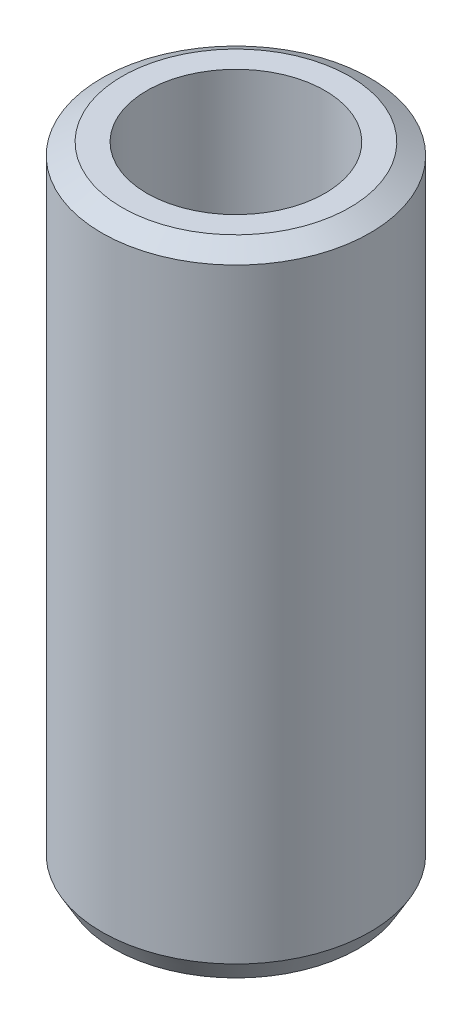
ISO-10303-21;
HEADER;
FILE_DESCRIPTION(('STEP AP214'),'2;1');
FILE_NAME('part.step','',(''),(''),'','','');
FILE_SCHEMA(('AUTOMOTIVE_DESIGN { 1 0 10303 214 1 1 1 1 }'));
ENDSEC;
DATA;
#1=APPLICATION_CONTEXT('core data for automotive mechanical design processes');
#2=APPLICATION_PROTOCOL_DEFINITION('international standard','automotive_design',2000,#1);
#3=PRODUCT_CONTEXT('',#1,'mechanical');
#4=PRODUCT('Part','Part','',(#3));
#5=PRODUCT_RELATED_PRODUCT_CATEGORY('part','',(#4));
#6=PRODUCT_DEFINITION_FORMATION('','',#4);
#7=PRODUCT_DEFINITION_CONTEXT('part definition',#1,'design');
#8=PRODUCT_DEFINITION('design','',#6,#7);
#9=PRODUCT_DEFINITION_SHAPE('','',#8);
#10=(LENGTH_UNIT() NAMED_UNIT(*) SI_UNIT(.MILLI.,.METRE.));
#11=(NAMED_UNIT(*) PLANE_ANGLE_UNIT() SI_UNIT($,.RADIAN.));
#12=(NAMED_UNIT(*) SI_UNIT($,.STERADIAN.) SOLID_ANGLE_UNIT());
#13=UNCERTAINTY_MEASURE_WITH_UNIT(LENGTH_MEASURE(1.E-05),#10,'distance_accuracy_value','');
#14=(GEOMETRIC_REPRESENTATION_CONTEXT(3) GLOBAL_UNCERTAINTY_ASSIGNED_CONTEXT((#13)) GLOBAL_UNIT_ASSIGNED_CONTEXT((#10,
#11,#12)) REPRESENTATION_CONTEXT('',''));
#15=CARTESIAN_POINT('',(0.,0.,0.));
#16=DIRECTION('',(0.,0.,1.));
#17=DIRECTION('',(1.,0.,0.));
#18=AXIS2_PLACEMENT_3D('',#15,#16,#17);
#19=CARTESIAN_POINT('',(0.,130.671147761146,0.));
#20=DIRECTION('',(0.,-1.,0.));
#21=DIRECTION('',(0.,0.,-1.));
#22=AXIS2_PLACEMENT_3D('',#19,#20,#21);
#23=CYLINDRICAL_SURFACE('',#22,27.5);
#24=CARTESIAN_POINT('',(0.,128.257968518179,0.));
#25=DIRECTION('',(0.,1.,0.));
#26=DIRECTION('',(0.,0.,1.));
#27=AXIS2_PLACEMENT_3D('',#24,#25,#26);
#28=CIRCLE('',#27,27.5);
#29=CARTESIAN_POINT('',(0.,128.257968518179,27.5));
#30=VERTEX_POINT('',#29);
#31=EDGE_CURVE('E50',#30,#30,#28,.F.);
#32=ORIENTED_EDGE('',*,*,#31,.T.);
#33=EDGE_LOOP('',(#32));
#34=FACE_BOUND('',#33,.T.);
#35=CARTESIAN_POINT('',(0.,4.17974905658983,0.));
#36=DIRECTION('',(0.,1.,0.));
#37=DIRECTION('',(0.,0.,1.));
#38=AXIS2_PLACEMENT_3D('',#35,#36,#37);
#39=CIRCLE('',#38,27.5);
#40=CARTESIAN_POINT('',(0.,4.17974905658983,27.5));
#41=VERTEX_POINT('',#40);
#42=EDGE_CURVE('E51',#41,#41,#39,.T.);
#43=ORIENTED_EDGE('',*,*,#42,.T.);
#44=EDGE_LOOP('',(#43));
#45=FACE_BOUND('',#44,.T.);
#46=ADVANCED_FACE('F39',(#34,#45),#23,.T.);
#47=CARTESIAN_POINT('',(0.,130.671147761146,0.));
#48=DIRECTION('',(0.,1.,0.));
#49=DIRECTION('',(0.,0.,1.));
#50=AXIS2_PLACEMENT_3D('',#47,#48,#49);
#51=PLANE('',#50);
#52=CARTESIAN_POINT('',(0.,130.671147761146,0.));
#53=DIRECTION('',(0.,1.,0.));
#54=DIRECTION('',(0.,0.,1.));
#55=AXIS2_PLACEMENT_3D('',#52,#53,#54);
#56=CIRCLE('',#55,23.3202509434103);
#57=CARTESIAN_POINT('',(0.,130.671147761146,23.3202509434103));
#58=VERTEX_POINT('',#57);
#59=EDGE_CURVE('E54',#58,#58,#56,.T.);
#60=ORIENTED_EDGE('',*,*,#59,.T.);
#61=EDGE_LOOP('',(#60));
#62=FACE_BOUND('',#61,.T.);
#63=CARTESIAN_POINT('',(0.,130.671147761146,0.));
#64=DIRECTION('',(0.,1.,0.));
#65=DIRECTION('',(0.,0.,1.));
#66=AXIS2_PLACEMENT_3D('',#63,#64,#65);
#67=CIRCLE('',#66,18.251921950778);
#68=CARTESIAN_POINT('',(0.,130.671147761146,18.251921950778));
#69=VERTEX_POINT('',#68);
#70=EDGE_CURVE('E58',#69,#69,#67,.T.);
#71=ORIENTED_EDGE('',*,*,#70,.F.);
#72=EDGE_LOOP('',(#71));
#73=FACE_BOUND('',#72,.T.);
#74=ADVANCED_FACE('F69',(#62,#73),#51,.T.);
#75=CARTESIAN_POINT('',(0.,0.,0.));
#76=DIRECTION('',(0.,1.,0.));
#77=DIRECTION('',(0.,0.,1.));
#78=AXIS2_PLACEMENT_3D('',#75,#76,#77);
#79=PLANE('',#78);
#80=CARTESIAN_POINT('',(0.,0.,0.));
#81=DIRECTION('',(0.,1.,0.));
#82=DIRECTION('',(0.,0.,1.));
#83=AXIS2_PLACEMENT_3D('',#80,#81,#82);
#84=CIRCLE('',#83,25.0868207570328);
#85=CARTESIAN_POINT('',(0.,0.,25.0868207570328));
#86=VERTEX_POINT('',#85);
#87=EDGE_CURVE('E10',#86,#86,#84,.F.);
#88=ORIENTED_EDGE('',*,*,#87,.T.);
#89=EDGE_LOOP('',(#88));
#90=FACE_BOUND('',#89,.T.);
#91=CARTESIAN_POINT('',(0.,0.,0.));
#92=DIRECTION('',(0.,1.,0.));
#93=DIRECTION('',(0.,0.,1.));
#94=AXIS2_PLACEMENT_3D('',#91,#92,#93);
#95=CIRCLE('',#94,18.251921950778);
#96=CARTESIAN_POINT('',(0.,0.,18.251921950778));
#97=VERTEX_POINT('',#96);
#98=EDGE_CURVE('E63',#97,#97,#95,.T.);
#99=ORIENTED_EDGE('',*,*,#98,.T.);
#100=EDGE_LOOP('',(#99));
#101=FACE_BOUND('',#100,.T.);
#102=ADVANCED_FACE('F75',(#90,#101),#79,.F.);
#103=CARTESIAN_POINT('',(0.,130.671147761146,0.));
#104=DIRECTION('',(0.,-1.,0.));
#105=DIRECTION('',(0.,0.,-1.));
#106=AXIS2_PLACEMENT_3D('',#103,#104,#105);
#107=CYLINDRICAL_SURFACE('',#106,18.251921950778);
#108=ORIENTED_EDGE('',*,*,#70,.T.);
#109=EDGE_LOOP('',(#108));
#110=FACE_BOUND('',#109,.T.);
#111=ORIENTED_EDGE('',*,*,#98,.F.);
#112=EDGE_LOOP('',(#111));
#113=FACE_BOUND('',#112,.T.);
#114=ADVANCED_FACE('F70',(#110,#113),#107,.F.);
#115=CARTESIAN_POINT('',(0.,130.671147761146,0.));
#116=DIRECTION('',(0.,-1.,0.));
#117=DIRECTION('',(0.,0.,-1.));
#118=AXIS2_PLACEMENT_3D('',#115,#116,#117);
#119=CONICAL_SURFACE('',#118,23.3202509434103,1.04719755119659);
#120=ORIENTED_EDGE('',*,*,#31,.F.);
#121=EDGE_LOOP('',(#120));
#122=FACE_BOUND('',#121,.T.);
#123=ORIENTED_EDGE('',*,*,#59,.F.);
#124=EDGE_LOOP('',(#123));
#125=FACE_BOUND('',#124,.T.);
#126=ADVANCED_FACE('F81',(#122,#125),#119,.T.);
#127=CARTESIAN_POINT('',(0.,4.17974905658983,0.));
#128=DIRECTION('',(0.,1.,0.));
#129=DIRECTION('',(0.,0.,1.));
#130=AXIS2_PLACEMENT_3D('',#127,#128,#129);
#131=CONICAL_SURFACE('',#130,27.5,0.523598775598303);
#132=ORIENTED_EDGE('',*,*,#87,.F.);
#133=EDGE_LOOP('',(#132));
#134=FACE_BOUND('',#133,.T.);
#135=ORIENTED_EDGE('',*,*,#42,.F.);
#136=EDGE_LOOP('',(#135));
#137=FACE_BOUND('',#136,.T.);
#138=ADVANCED_FACE('F45',(#134,#137),#131,.T.);
#139=CLOSED_SHELL('',(#46,#74,#102,#114,#126,#138));
#140=MANIFOLD_SOLID_BREP('B2',#139);
#141=ADVANCED_BREP_SHAPE_REPRESENTATION('',(#18,#140),#14);
#142=SHAPE_DEFINITION_REPRESENTATION(#9,#141);
ENDSEC;
END-ISO-10303-21;
